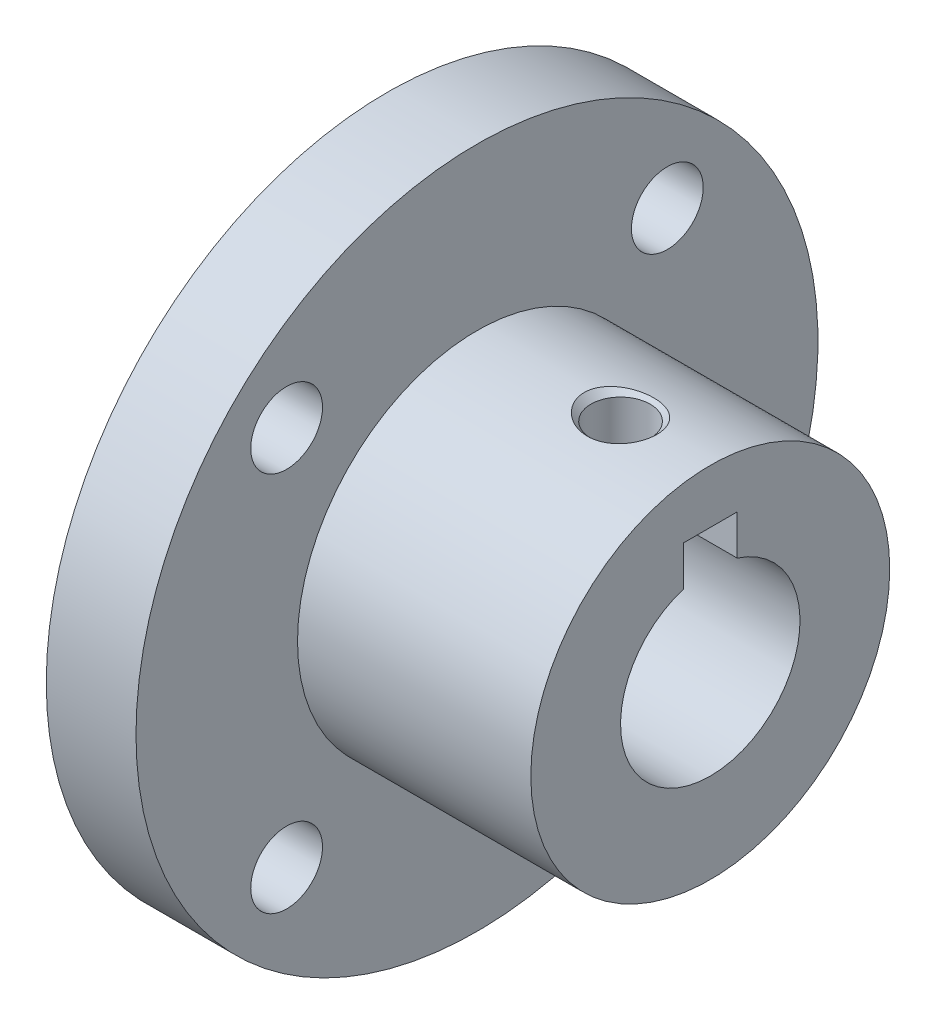
ISO-10303-21;
HEADER;
FILE_DESCRIPTION(('STEP AP214'),'2;1');
FILE_NAME('part.step','',(''),(''),'','','');
FILE_SCHEMA(('AUTOMOTIVE_DESIGN { 1 0 10303 214 1 1 1 1 }'));
ENDSEC;
DATA;
#1=APPLICATION_CONTEXT('core data for automotive mechanical design processes');
#2=APPLICATION_PROTOCOL_DEFINITION('international standard','automotive_design',2000,#1);
#3=PRODUCT_CONTEXT('',#1,'mechanical');
#4=PRODUCT('Part','Part','',(#3));
#5=PRODUCT_RELATED_PRODUCT_CATEGORY('part','',(#4));
#6=PRODUCT_DEFINITION_FORMATION('','',#4);
#7=PRODUCT_DEFINITION_CONTEXT('part definition',#1,'design');
#8=PRODUCT_DEFINITION('design','',#6,#7);
#9=PRODUCT_DEFINITION_SHAPE('','',#8);
#10=(LENGTH_UNIT() NAMED_UNIT(*) SI_UNIT(.MILLI.,.METRE.));
#11=(NAMED_UNIT(*) PLANE_ANGLE_UNIT() SI_UNIT($,.RADIAN.));
#12=(NAMED_UNIT(*) SI_UNIT($,.STERADIAN.) SOLID_ANGLE_UNIT());
#13=UNCERTAINTY_MEASURE_WITH_UNIT(LENGTH_MEASURE(1.E-05),#10,'distance_accuracy_value','');
#14=(GEOMETRIC_REPRESENTATION_CONTEXT(3) GLOBAL_UNCERTAINTY_ASSIGNED_CONTEXT((#13)) GLOBAL_UNIT_ASSIGNED_CONTEXT((#10,
#11,#12)) REPRESENTATION_CONTEXT('',''));
#15=CARTESIAN_POINT('',(0.,0.,0.));
#16=DIRECTION('',(0.,0.,1.));
#17=DIRECTION('',(1.,0.,0.));
#18=AXIS2_PLACEMENT_3D('',#15,#16,#17);
#19=CARTESIAN_POINT('',(13.,0.,0.));
#20=DIRECTION('',(-1.,0.,0.));
#21=DIRECTION('',(0.,0.,1.));
#22=AXIS2_PLACEMENT_3D('',#19,#20,#21);
#23=CYLINDRICAL_SURFACE('',#22,10.);
#24=CARTESIAN_POINT('',(6.62523194216559,9.90736802604839,-1.35796131641272));
#25=CARTESIAN_POINT('',(6.69783919281197,9.89893781323184,-1.41946863578843));
#26=CARTESIAN_POINT('',(6.77491076012761,9.89064161185237,-1.47574898579946));
#27=CARTESIAN_POINT('',(6.93621862361755,9.87498344965347,-1.57712931763381));
#28=CARTESIAN_POINT('',(7.02046116773056,9.86762231774959,-1.62221941287872));
#29=CARTESIAN_POINT('',(7.21233838553293,9.85304586092752,-1.7087444626504));
#30=CARTESIAN_POINT('',(7.32121454297018,9.84617361659741,-1.74750834745706));
#31=CARTESIAN_POINT('',(7.54388947643843,9.83537879828483,-1.80727639277504));
#32=CARTESIAN_POINT('',(7.6576904047215,9.83145752800609,-1.82827270430212));
#33=CARTESIAN_POINT('',(7.89207227344909,9.82689477486347,-1.8526491605562));
#34=CARTESIAN_POINT('',(8.01273748718097,9.82639762440689,-1.85525419181856));
#35=CARTESIAN_POINT('',(8.25283674094449,9.82912632962595,-1.84074068154992));
#36=CARTESIAN_POINT('',(8.37227069449417,9.83235244504501,-1.82362076396227));
#37=CARTESIAN_POINT('',(8.60775519415414,9.84220308661511,-1.76968755000167));
#38=CARTESIAN_POINT('',(8.72375918874116,9.84886172005461,-1.73267644427726));
#39=CARTESIAN_POINT('',(8.9476467818367,9.86479978630317,-1.63949644809677));
#40=CARTESIAN_POINT('',(9.05552983331101,9.87407939546384,-1.58332626847493));
#41=CARTESIAN_POINT('',(9.25752884889123,9.8939055283814,-1.45423433238783));
#42=CARTESIAN_POINT('',(9.35188217067214,9.90442209765625,-1.38168054839768));
#43=CARTESIAN_POINT('',(9.52593422696576,9.92554684431106,-1.22068986754564));
#44=CARTESIAN_POINT('',(9.60563846790559,9.93615498569378,-1.13225896352841));
#45=CARTESIAN_POINT('',(9.74219766665582,9.95536166877077,-0.948031147495123));
#46=CARTESIAN_POINT('',(9.80021427543135,9.96404667399645,-0.853106817833625));
#47=CARTESIAN_POINT('',(9.89760593551252,9.97909069905062,-0.653967103621671));
#48=CARTESIAN_POINT('',(9.93699638125858,9.98545163871683,-0.549759476636914));
#49=CARTESIAN_POINT('',(9.99214198981141,9.99448215639824,-0.345981470444367));
#50=CARTESIAN_POINT('',(10.0098206093733,9.99745017058104,-0.246943190152349));
#51=CARTESIAN_POINT('',(10.0273088049741,10.0003856828198,-0.0472696538945304));
#52=CARTESIAN_POINT('',(10.0271260317223,10.00035446556,0.0533648998585387));
#53=CARTESIAN_POINT('',(10.0094925994018,9.9973955986688,0.246682928147122));
#54=CARTESIAN_POINT('',(9.99312165692085,9.99464905770645,0.339470305692501));
#55=CARTESIAN_POINT('',(9.94545803929661,9.98683169281562,0.521010384653564));
#56=CARTESIAN_POINT('',(9.91416486083189,9.98176079048754,0.609762949865935));
#57=CARTESIAN_POINT('',(9.83731203614464,9.96972301768392,0.782464125794809));
#58=CARTESIAN_POINT('',(9.79152452197848,9.96272611487291,0.866308728834184));
#59=CARTESIAN_POINT('',(9.68754845694668,9.94757234804424,1.02578406128009));
#60=CARTESIAN_POINT('',(9.62935633569942,9.93941515028769,1.10141241634669));
#61=CARTESIAN_POINT('',(9.49745056621509,9.92204036888061,1.24861234707649));
#62=CARTESIAN_POINT('',(9.42288298851593,9.91278961610896,1.31941399778415));
#63=CARTESIAN_POINT('',(9.26371727552612,9.89472007076736,1.44871894926825));
#64=CARTESIAN_POINT('',(9.17911528952318,9.8859014458733,1.50721750468489));
#65=CARTESIAN_POINT('',(8.99411907198208,9.86877679458821,1.61571569995325));
#66=CARTESIAN_POINT('',(8.89298894838898,9.8605878511428,1.66448096588397));
#67=CARTESIAN_POINT('',(8.68419371357368,9.84655294135032,1.74559260958259));
#68=CARTESIAN_POINT('',(8.57652669079741,9.84070766418702,1.77793415849942));
#69=CARTESIAN_POINT('',(8.35080924067217,9.83169934741051,1.82711867402177));
#70=CARTESIAN_POINT('',(8.23252303332838,9.82871777907494,1.84291819403846));
#71=CARTESIAN_POINT('',(7.99490994809975,9.8264037051387,1.85521639700497));
#72=CARTESIAN_POINT('',(7.87558291027889,9.82707177057367,1.8517120595988));
#73=CARTESIAN_POINT('',(7.63665824826107,9.83203394576607,1.82518371839159));
#74=CARTESIAN_POINT('',(7.51710686788591,9.83640337684123,1.80175420602767));
#75=CARTESIAN_POINT('',(7.28373855388937,9.84835156741167,1.73525339810649));
#76=CARTESIAN_POINT('',(7.16992216664747,9.85593063204801,1.69218023499007));
#77=CARTESIAN_POINT('',(6.95248803059956,9.87330462079541,1.58764853274368));
#78=CARTESIAN_POINT('',(6.8487880743695,9.88307909243764,1.52635810235744));
#79=CARTESIAN_POINT('',(6.65391834298901,9.90367829676326,1.38641240493075));
#80=CARTESIAN_POINT('',(6.56274646663267,9.91450285280598,1.30776005560808));
#81=CARTESIAN_POINT('',(6.40062237541939,9.9352574532267,1.13908188823872));
#82=CARTESIAN_POINT('',(6.32889783389474,9.94520533201563,1.04980300437586));
#83=CARTESIAN_POINT('',(6.20321997935349,9.96346461692173,0.859348884798333));
#84=CARTESIAN_POINT('',(6.14925327297398,9.97177725446308,0.758182693279938));
#85=CARTESIAN_POINT('',(6.06595980237666,9.98494524743889,0.556854108635767));
#86=CARTESIAN_POINT('',(6.03482117464642,9.99004854569139,0.457457749779857));
#87=CARTESIAN_POINT('',(5.99114012573514,9.99727291206658,0.254568224808397));
#88=CARTESIAN_POINT('',(5.97858573935232,9.99939589897517,0.151077738751544));
#89=CARTESIAN_POINT('',(5.97298519710513,10.0003395680486,-0.0478751925700371));
#90=CARTESIAN_POINT('',(5.97841756367136,9.99941781699535,-0.143296865694244));
#91=CARTESIAN_POINT('',(6.00522902975338,9.99493833645858,-0.331805238567409));
#92=CARTESIAN_POINT('',(6.02660820990853,9.99138059364546,-0.424891926506421));
#93=CARTESIAN_POINT('',(6.08400648006393,9.98207905300167,-0.605113148381078));
#94=CARTESIAN_POINT('',(6.11985669421795,9.97636051903066,-0.692303237133997));
#95=CARTESIAN_POINT('',(6.20475637192994,9.96332123842221,-0.85982156892986));
#96=CARTESIAN_POINT('',(6.25380276089865,9.95600086507294,-0.94015140461344));
#97=CARTESIAN_POINT('',(6.35410252566645,9.94177087307553,-1.07946317263931));
#98=CARTESIAN_POINT('',(6.40357528819235,9.93500166335472,-1.13975648501532));
#99=CARTESIAN_POINT('',(6.50944812354738,9.92124773343471,-1.25385164781352));
#100=CARTESIAN_POINT('',(6.56584682506399,9.9142630561018,-1.30765477910116));
#101=CARTESIAN_POINT('',(6.62523194216559,9.90736802604839,-1.35796131641272));
#102=B_SPLINE_CURVE_WITH_KNOTS('',3,(#24,#25,#26,#27,#28,#29,#30,#31,#32,#33,#34,#35,#36,#37,
#38,#39,#40,#41,#42,#43,#44,#45,#46,#47,#48,#49,#50,#51,#52,#53,#54,#55,#56,#57,#58,#59,#60,#61,
#62,#63,#64,#65,#66,#67,#68,#69,#70,#71,#72,#73,#74,#75,#76,#77,#78,#79,#80,#81,#82,#83,#84,#85,
#86,#87,#88,#89,#90,#91,#92,#93,#94,#95,#96,#97,#98,#99,#100,#101),.UNSPECIFIED.,.T.,.F.,(4,2,2,
2,2,2,2,2,2,2,2,2,2,2,2,2,2,2,2,2,2,2,2,2,2,2,2,2,2,2,2,2,2,2,2,2,2,2,4),(0.,0.28638592568935,
0.573023979432038,0.918769623563071,1.26466792430608,1.62506176926063,1.98548075761981,
2.34955213571681,2.71364801609278,3.07026159692397,3.42674085528171,3.75966963128088,
4.09232276009592,4.39267818223635,4.69290495136607,4.97437171871268,5.25584798049907,
5.54198967802629,5.82821384635188,6.13664362869989,6.4451921565268,6.7814391947746,
7.11778503819274,7.47426132414426,7.83079338733426,8.19476000774969,8.55876123837842,
8.91950258000226,9.28018334415166,9.62317582205825,9.96590901110252,10.2770696512965,
10.5880298678335,10.8733805021873,11.1587325795036,11.4408466889663,11.72289512523,
11.9571750927887,12.1914087482695),.UNSPECIFIED.);
#103=CARTESIAN_POINT('',(6.62523194216559,9.90736802604839,-1.35796131641272));
#104=VERTEX_POINT('',#103);
#105=EDGE_CURVE('E232',#104,#104,#102,.T.);
#106=ORIENTED_EDGE('',*,*,#105,.T.);
#107=EDGE_LOOP('',(#106));
#108=FACE_BOUND('',#107,.T.);
#109=CARTESIAN_POINT('',(13.,0.,0.));
#110=DIRECTION('',(1.,0.,0.));
#111=DIRECTION('',(0.,0.,-1.));
#112=AXIS2_PLACEMENT_3D('',#109,#110,#111);
#113=CIRCLE('',#112,10.);
#114=CARTESIAN_POINT('',(13.,0.,-10.));
#115=VERTEX_POINT('',#114);
#116=EDGE_CURVE('E228',#115,#115,#113,.T.);
#117=ORIENTED_EDGE('',*,*,#116,.F.);
#118=EDGE_LOOP('',(#117));
#119=FACE_BOUND('',#118,.T.);
#120=CARTESIAN_POINT('',(0.,0.,0.));
#121=DIRECTION('',(1.,0.,0.));
#122=DIRECTION('',(0.,0.,-1.));
#123=AXIS2_PLACEMENT_3D('',#120,#121,#122);
#124=CIRCLE('',#123,10.);
#125=CARTESIAN_POINT('',(0.,0.,-10.));
#126=VERTEX_POINT('',#125);
#127=EDGE_CURVE('E224',#126,#126,#124,.T.);
#128=ORIENTED_EDGE('',*,*,#127,.T.);
#129=EDGE_LOOP('',(#128));
#130=FACE_BOUND('',#129,.T.);
#131=ADVANCED_FACE('F51',(#108,#119,#130),#23,.T.);
#132=CARTESIAN_POINT('',(13.,0.,0.));
#133=DIRECTION('',(1.,0.,0.));
#134=DIRECTION('',(0.,0.,-1.));
#135=AXIS2_PLACEMENT_3D('',#132,#133,#134);
#136=PLANE('',#135);
#137=DIRECTION('',(0.,1.,0.));
#138=VECTOR('',#137,1.);
#139=CARTESIAN_POINT('',(13.,7.,-1.5));
#140=LINE('',#139,#138);
#141=CARTESIAN_POINT('',(13.,4.76969600708473,-1.5));
#142=VERTEX_POINT('',#141);
#143=CARTESIAN_POINT('',(13.,7.,-1.5));
#144=VERTEX_POINT('',#143);
#145=EDGE_CURVE('E155',#142,#144,#140,.T.);
#146=ORIENTED_EDGE('',*,*,#145,.F.);
#147=CARTESIAN_POINT('',(13.,0.,0.));
#148=DIRECTION('',(1.,0.,0.));
#149=DIRECTION('',(0.,0.,-1.));
#150=AXIS2_PLACEMENT_3D('',#147,#148,#149);
#151=CIRCLE('',#150,5.);
#152=CARTESIAN_POINT('',(13.,4.76969600708473,1.5));
#153=VERTEX_POINT('',#152);
#154=EDGE_CURVE('E175',#153,#142,#151,.T.);
#155=ORIENTED_EDGE('',*,*,#154,.F.);
#156=DIRECTION('',(0.,-1.,0.));
#157=VECTOR('',#156,1.);
#158=CARTESIAN_POINT('',(13.,7.,1.5));
#159=LINE('',#158,#157);
#160=CARTESIAN_POINT('',(13.,7.,1.5));
#161=VERTEX_POINT('',#160);
#162=EDGE_CURVE('E75',#161,#153,#159,.T.);
#163=ORIENTED_EDGE('',*,*,#162,.F.);
#164=DIRECTION('',(0.,0.,1.));
#165=VECTOR('',#164,1.);
#166=CARTESIAN_POINT('',(13.,7.,-1.5));
#167=LINE('',#166,#165);
#168=EDGE_CURVE('E151',#144,#161,#167,.T.);
#169=ORIENTED_EDGE('',*,*,#168,.F.);
#170=EDGE_LOOP('',(#146,#155,#163,#169));
#171=FACE_BOUND('',#170,.T.);
#172=ORIENTED_EDGE('',*,*,#116,.T.);
#173=EDGE_LOOP('',(#172));
#174=FACE_BOUND('',#173,.T.);
#175=ADVANCED_FACE('F282',(#171,#174),#136,.T.);
#176=CARTESIAN_POINT('',(-5.,0.,0.));
#177=DIRECTION('',(-1.,0.,0.));
#178=DIRECTION('',(0.,0.,1.));
#179=AXIS2_PLACEMENT_3D('',#176,#177,#178);
#180=PLANE('',#179);
#181=DIRECTION('',(0.,1.,0.));
#182=VECTOR('',#181,1.);
#183=CARTESIAN_POINT('',(-5.,7.,-1.5));
#184=LINE('',#183,#182);
#185=CARTESIAN_POINT('',(-5.,4.76969600708473,-1.5));
#186=VERTEX_POINT('',#185);
#187=CARTESIAN_POINT('',(-5.,7.,-1.5));
#188=VERTEX_POINT('',#187);
#189=EDGE_CURVE('E121',#186,#188,#184,.T.);
#190=ORIENTED_EDGE('',*,*,#189,.T.);
#191=DIRECTION('',(0.,0.,1.));
#192=VECTOR('',#191,1.);
#193=CARTESIAN_POINT('',(-5.,7.,-1.5));
#194=LINE('',#193,#192);
#195=CARTESIAN_POINT('',(-5.,7.,1.5));
#196=VERTEX_POINT('',#195);
#197=EDGE_CURVE('E131',#188,#196,#194,.T.);
#198=ORIENTED_EDGE('',*,*,#197,.T.);
#199=DIRECTION('',(0.,-1.,0.));
#200=VECTOR('',#199,1.);
#201=CARTESIAN_POINT('',(-5.,7.,1.5));
#202=LINE('',#201,#200);
#203=CARTESIAN_POINT('',(-5.,4.76969600708473,1.5));
#204=VERTEX_POINT('',#203);
#205=EDGE_CURVE('E138',#196,#204,#202,.T.);
#206=ORIENTED_EDGE('',*,*,#205,.T.);
#207=CARTESIAN_POINT('',(-5.,0.,0.));
#208=DIRECTION('',(-1.,0.,0.));
#209=DIRECTION('',(0.,0.,1.));
#210=AXIS2_PLACEMENT_3D('',#207,#208,#209);
#211=CIRCLE('',#210,5.);
#212=EDGE_CURVE('E144',#186,#204,#211,.T.);
#213=ORIENTED_EDGE('',*,*,#212,.F.);
#214=EDGE_LOOP('',(#190,#198,#206,#213));
#215=FACE_BOUND('',#214,.T.);
#216=CARTESIAN_POINT('',(-5.,-10.6066017177982,10.6066017177982));
#217=DIRECTION('',(-1.,0.,0.));
#218=DIRECTION('',(0.,0.,1.));
#219=AXIS2_PLACEMENT_3D('',#216,#217,#218);
#220=CIRCLE('',#219,2.);
#221=CARTESIAN_POINT('',(-5.,-10.6066017177982,12.6066017177982));
#222=VERTEX_POINT('',#221);
#223=EDGE_CURVE('E196',#222,#222,#220,.T.);
#224=ORIENTED_EDGE('',*,*,#223,.F.);
#225=EDGE_LOOP('',(#224));
#226=FACE_BOUND('',#225,.T.);
#227=CARTESIAN_POINT('',(-5.,10.6066017177982,-10.6066017177982));
#228=DIRECTION('',(-1.,0.,0.));
#229=DIRECTION('',(0.,0.,1.));
#230=AXIS2_PLACEMENT_3D('',#227,#228,#229);
#231=CIRCLE('',#230,2.);
#232=CARTESIAN_POINT('',(-5.,10.6066017177982,-8.6066017177982));
#233=VERTEX_POINT('',#232);
#234=EDGE_CURVE('E212',#233,#233,#231,.T.);
#235=ORIENTED_EDGE('',*,*,#234,.F.);
#236=EDGE_LOOP('',(#235));
#237=FACE_BOUND('',#236,.T.);
#238=CARTESIAN_POINT('',(-5.,0.,0.));
#239=DIRECTION('',(-1.,0.,0.));
#240=DIRECTION('',(0.,0.,1.));
#241=AXIS2_PLACEMENT_3D('',#238,#239,#240);
#242=CIRCLE('',#241,19.);
#243=CARTESIAN_POINT('',(-5.,0.,19.));
#244=VERTEX_POINT('',#243);
#245=EDGE_CURVE('E220',#244,#244,#242,.T.);
#246=ORIENTED_EDGE('',*,*,#245,.T.);
#247=EDGE_LOOP('',(#246));
#248=FACE_BOUND('',#247,.T.);
#249=CARTESIAN_POINT('',(-5.,10.6066017177982,10.6066017177982));
#250=DIRECTION('',(-1.,0.,0.));
#251=DIRECTION('',(0.,0.,-1.));
#252=AXIS2_PLACEMENT_3D('',#249,#250,#251);
#253=CIRCLE('',#252,2.);
#254=CARTESIAN_POINT('',(-5.,10.6066017177982,8.6066017177982));
#255=VERTEX_POINT('',#254);
#256=EDGE_CURVE('E204',#255,#255,#253,.T.);
#257=ORIENTED_EDGE('',*,*,#256,.F.);
#258=EDGE_LOOP('',(#257));
#259=FACE_BOUND('',#258,.T.);
#260=CARTESIAN_POINT('',(-5.,-10.6066017177982,-10.6066017177982));
#261=DIRECTION('',(-1.,0.,0.));
#262=DIRECTION('',(0.,0.,-1.));
#263=AXIS2_PLACEMENT_3D('',#260,#261,#262);
#264=CIRCLE('',#263,2.);
#265=CARTESIAN_POINT('',(-5.,-10.6066017177982,-12.6066017177982));
#266=VERTEX_POINT('',#265);
#267=EDGE_CURVE('E188',#266,#266,#264,.T.);
#268=ORIENTED_EDGE('',*,*,#267,.F.);
#269=EDGE_LOOP('',(#268));
#270=FACE_BOUND('',#269,.T.);
#271=ADVANCED_FACE('F141',(#215,#226,#237,#248,#259,#270),#180,.T.);
#272=CARTESIAN_POINT('',(0.,0.,0.));
#273=DIRECTION('',(-1.,0.,0.));
#274=DIRECTION('',(0.,0.,1.));
#275=AXIS2_PLACEMENT_3D('',#272,#273,#274);
#276=PLANE('',#275);
#277=ORIENTED_EDGE('',*,*,#127,.F.);
#278=EDGE_LOOP('',(#277));
#279=FACE_BOUND('',#278,.T.);
#280=CARTESIAN_POINT('',(0.,0.,0.));
#281=DIRECTION('',(-1.,0.,0.));
#282=DIRECTION('',(0.,0.,1.));
#283=AXIS2_PLACEMENT_3D('',#280,#281,#282);
#284=CIRCLE('',#283,19.);
#285=CARTESIAN_POINT('',(0.,0.,19.));
#286=VERTEX_POINT('',#285);
#287=EDGE_CURVE('E216',#286,#286,#284,.T.);
#288=ORIENTED_EDGE('',*,*,#287,.F.);
#289=EDGE_LOOP('',(#288));
#290=FACE_BOUND('',#289,.T.);
#291=CARTESIAN_POINT('',(0.,10.6066017177982,-10.6066017177982));
#292=DIRECTION('',(-1.,0.,0.));
#293=DIRECTION('',(0.,0.,1.));
#294=AXIS2_PLACEMENT_3D('',#291,#292,#293);
#295=CIRCLE('',#294,2.);
#296=CARTESIAN_POINT('',(0.,10.6066017177982,-8.6066017177982));
#297=VERTEX_POINT('',#296);
#298=EDGE_CURVE('E208',#297,#297,#295,.T.);
#299=ORIENTED_EDGE('',*,*,#298,.T.);
#300=EDGE_LOOP('',(#299));
#301=FACE_BOUND('',#300,.T.);
#302=CARTESIAN_POINT('',(0.,10.6066017177982,10.6066017177982));
#303=DIRECTION('',(-1.,0.,0.));
#304=DIRECTION('',(0.,0.,-1.));
#305=AXIS2_PLACEMENT_3D('',#302,#303,#304);
#306=CIRCLE('',#305,2.);
#307=CARTESIAN_POINT('',(0.,10.6066017177982,8.6066017177982));
#308=VERTEX_POINT('',#307);
#309=EDGE_CURVE('E200',#308,#308,#306,.T.);
#310=ORIENTED_EDGE('',*,*,#309,.T.);
#311=EDGE_LOOP('',(#310));
#312=FACE_BOUND('',#311,.T.);
#313=CARTESIAN_POINT('',(0.,-10.6066017177982,10.6066017177982));
#314=DIRECTION('',(-1.,0.,0.));
#315=DIRECTION('',(0.,0.,1.));
#316=AXIS2_PLACEMENT_3D('',#313,#314,#315);
#317=CIRCLE('',#316,2.);
#318=CARTESIAN_POINT('',(0.,-10.6066017177982,12.6066017177982));
#319=VERTEX_POINT('',#318);
#320=EDGE_CURVE('E192',#319,#319,#317,.T.);
#321=ORIENTED_EDGE('',*,*,#320,.T.);
#322=EDGE_LOOP('',(#321));
#323=FACE_BOUND('',#322,.T.);
#324=CARTESIAN_POINT('',(0.,-10.6066017177982,-10.6066017177982));
#325=DIRECTION('',(-1.,0.,0.));
#326=DIRECTION('',(0.,0.,-1.));
#327=AXIS2_PLACEMENT_3D('',#324,#325,#326);
#328=CIRCLE('',#327,2.);
#329=CARTESIAN_POINT('',(0.,-10.6066017177982,-12.6066017177982));
#330=VERTEX_POINT('',#329);
#331=EDGE_CURVE('E187',#330,#330,#328,.T.);
#332=ORIENTED_EDGE('',*,*,#331,.T.);
#333=EDGE_LOOP('',(#332));
#334=FACE_BOUND('',#333,.T.);
#335=ADVANCED_FACE('F281',(#279,#290,#301,#312,#323,#334),#276,.F.);
#336=CARTESIAN_POINT('',(-5.,0.,0.));
#337=DIRECTION('',(1.,0.,0.));
#338=DIRECTION('',(0.,0.,-1.));
#339=AXIS2_PLACEMENT_3D('',#336,#337,#338);
#340=CYLINDRICAL_SURFACE('',#339,19.);
#341=ORIENTED_EDGE('',*,*,#245,.F.);
#342=EDGE_LOOP('',(#341));
#343=FACE_BOUND('',#342,.T.);
#344=ORIENTED_EDGE('',*,*,#287,.T.);
#345=EDGE_LOOP('',(#344));
#346=FACE_BOUND('',#345,.T.);
#347=ADVANCED_FACE('F277',(#343,#346),#340,.T.);
#348=CARTESIAN_POINT('',(-5.,10.6066017177982,-10.6066017177982));
#349=DIRECTION('',(1.,0.,0.));
#350=DIRECTION('',(0.,0.,-1.));
#351=AXIS2_PLACEMENT_3D('',#348,#349,#350);
#352=CYLINDRICAL_SURFACE('',#351,2.);
#353=ORIENTED_EDGE('',*,*,#234,.T.);
#354=EDGE_LOOP('',(#353));
#355=FACE_BOUND('',#354,.T.);
#356=ORIENTED_EDGE('',*,*,#298,.F.);
#357=EDGE_LOOP('',(#356));
#358=FACE_BOUND('',#357,.T.);
#359=ADVANCED_FACE('F273',(#355,#358),#352,.F.);
#360=CARTESIAN_POINT('',(-5.,10.6066017177982,10.6066017177982));
#361=DIRECTION('',(1.,0.,0.));
#362=DIRECTION('',(0.,0.,-1.));
#363=AXIS2_PLACEMENT_3D('',#360,#361,#362);
#364=CYLINDRICAL_SURFACE('',#363,2.);
#365=ORIENTED_EDGE('',*,*,#256,.T.);
#366=EDGE_LOOP('',(#365));
#367=FACE_BOUND('',#366,.T.);
#368=ORIENTED_EDGE('',*,*,#309,.F.);
#369=EDGE_LOOP('',(#368));
#370=FACE_BOUND('',#369,.T.);
#371=ADVANCED_FACE('F269',(#367,#370),#364,.F.);
#372=CARTESIAN_POINT('',(-5.,-10.6066017177982,10.6066017177982));
#373=DIRECTION('',(1.,0.,0.));
#374=DIRECTION('',(0.,0.,-1.));
#375=AXIS2_PLACEMENT_3D('',#372,#373,#374);
#376=CYLINDRICAL_SURFACE('',#375,2.);
#377=ORIENTED_EDGE('',*,*,#223,.T.);
#378=EDGE_LOOP('',(#377));
#379=FACE_BOUND('',#378,.T.);
#380=ORIENTED_EDGE('',*,*,#320,.F.);
#381=EDGE_LOOP('',(#380));
#382=FACE_BOUND('',#381,.T.);
#383=ADVANCED_FACE('F265',(#379,#382),#376,.F.);
#384=CARTESIAN_POINT('',(-5.,-10.6066017177982,-10.6066017177982));
#385=DIRECTION('',(1.,0.,0.));
#386=DIRECTION('',(0.,0.,-1.));
#387=AXIS2_PLACEMENT_3D('',#384,#385,#386);
#388=CYLINDRICAL_SURFACE('',#387,2.);
#389=ORIENTED_EDGE('',*,*,#267,.T.);
#390=EDGE_LOOP('',(#389));
#391=FACE_BOUND('',#390,.T.);
#392=ORIENTED_EDGE('',*,*,#331,.F.);
#393=EDGE_LOOP('',(#392));
#394=FACE_BOUND('',#393,.T.);
#395=ADVANCED_FACE('F254',(#391,#394),#388,.F.);
#396=CARTESIAN_POINT('',(8.,10.,0.));
#397=DIRECTION('',(0.,1.,0.));
#398=DIRECTION('',(0.,0.,1.));
#399=AXIS2_PLACEMENT_3D('',#396,#397,#398);
#400=CONICAL_SURFACE('',#399,2.025,0.785398163397446);
#401=CARTESIAN_POINT('',(8.,9.625,0.));
#402=DIRECTION('',(0.,1.,0.));
#403=DIRECTION('',(0.,0.,1.));
#404=AXIS2_PLACEMENT_3D('',#401,#402,#403);
#405=CIRCLE('',#404,1.65);
#406=CARTESIAN_POINT('',(8.,9.625,1.65));
#407=VERTEX_POINT('',#406);
#408=EDGE_CURVE('E182',#407,#407,#405,.T.);
#409=ORIENTED_EDGE('',*,*,#408,.F.);
#410=EDGE_LOOP('',(#409));
#411=FACE_BOUND('',#410,.T.);
#412=ORIENTED_EDGE('',*,*,#105,.F.);
#413=EDGE_LOOP('',(#412));
#414=FACE_BOUND('',#413,.T.);
#415=ADVANCED_FACE('F250',(#411,#414),#400,.F.);
#416=CARTESIAN_POINT('',(8.,10.,0.));
#417=DIRECTION('',(0.,1.,0.));
#418=DIRECTION('',(0.,0.,1.));
#419=AXIS2_PLACEMENT_3D('',#416,#417,#418);
#420=CYLINDRICAL_SURFACE('',#419,1.65);
#421=CARTESIAN_POINT('',(8.,7.,0.));
#422=DIRECTION('',(0.,1.,0.));
#423=DIRECTION('',(0.,0.,1.));
#424=AXIS2_PLACEMENT_3D('',#421,#422,#423);
#425=CIRCLE('',#424,1.65);
#426=CARTESIAN_POINT('',(7.31261364575663,7.,1.5));
#427=VERTEX_POINT('',#426);
#428=CARTESIAN_POINT('',(7.31261364575663,7.,-1.5));
#429=VERTEX_POINT('',#428);
#430=EDGE_CURVE('E13',#427,#429,#425,.F.);
#431=ORIENTED_EDGE('',*,*,#430,.T.);
#432=DIRECTION('',(0.,1.,0.));
#433=VECTOR('',#432,1.);
#434=CARTESIAN_POINT('',(7.31261364575663,10.,-1.5));
#435=LINE('',#434,#433);
#436=CARTESIAN_POINT('',(7.31261364575663,4.76969600708473,-1.5));
#437=VERTEX_POINT('',#436);
#438=EDGE_CURVE('E124',#429,#437,#435,.F.);
#439=ORIENTED_EDGE('',*,*,#438,.T.);
#440=CARTESIAN_POINT('',(8.,4.71990466005406,1.65));
#441=CARTESIAN_POINT('',(7.91007060070937,4.71990452115883,1.65000024360503));
#442=CARTESIAN_POINT('',(7.82014231350031,4.72250292266519,1.64262303818655));
#443=CARTESIAN_POINT('',(7.64294632656482,4.73256311651638,1.61340616817484));
#444=CARTESIAN_POINT('',(7.55567911253961,4.74002579119602,1.59156387973589));
#445=CARTESIAN_POINT('',(7.38640030062093,4.75887919770346,1.53426465819808));
#446=CARTESIAN_POINT('',(7.30437892233647,4.77026235105614,1.49883397722407));
#447=CARTESIAN_POINT('',(7.1474185036429,4.79566317693293,1.41545303535855));
#448=CARTESIAN_POINT('',(7.07248098153631,4.80968141232602,1.36750009878646));
#449=CARTESIAN_POINT('',(6.92894236061176,4.83937566103107,1.25846654308765));
#450=CARTESIAN_POINT('',(6.86065251426647,4.85509238793419,1.1969871597991));
#451=CARTESIAN_POINT('',(6.73514073232111,4.88606822622471,1.06349727663171));
#452=CARTESIAN_POINT('',(6.677920534534,4.90132726544299,0.991485126335476));
#453=CARTESIAN_POINT('',(6.57476641097718,4.93013890958224,0.836704215602399));
#454=CARTESIAN_POINT('',(6.52915769359331,4.94363804307574,0.753707887278362));
#455=CARTESIAN_POINT('',(6.45267126515024,4.9669298740668,0.580699685040884));
#456=CARTESIAN_POINT('',(6.42178966794346,4.97672354920831,0.490689669179503));
#457=CARTESIAN_POINT('',(6.37668692812485,4.99121262924257,0.309471831071058));
#458=CARTESIAN_POINT('',(6.36193278501146,4.99607073696453,0.218409916306845));
#459=CARTESIAN_POINT('',(6.34781000128519,5.00071837425094,0.0349820134684157));
#460=CARTESIAN_POINT('',(6.34843747215392,5.00050918484354,-0.0573836391159477));
#461=CARTESIAN_POINT('',(6.36471997454315,4.99515654976729,-0.237027933093925));
#462=CARTESIAN_POINT('',(6.3797962649372,4.99020313675408,-0.324365615952689));
#463=CARTESIAN_POINT('',(6.42359260318569,4.9761564157389,-0.495193577669011));
#464=CARTESIAN_POINT('',(6.45231357082426,4.96706282865059,-0.578683596740283));
#465=CARTESIAN_POINT('',(6.52292737806423,4.94551338736031,-0.740723104693063));
#466=CARTESIAN_POINT('',(6.56498668425741,4.93301533884174,-0.819194207586597));
#467=CARTESIAN_POINT('',(6.66094667503865,4.90596050876768,-0.96813740001638));
#468=CARTESIAN_POINT('',(6.71485060572331,4.89140316323876,-1.03860728872218));
#469=CARTESIAN_POINT('',(6.83589517646717,4.86097294536879,-1.1729917525873));
#470=CARTESIAN_POINT('',(6.90353230573436,4.84507036749807,-1.23645304594368));
#471=CARTESIAN_POINT('',(7.04862658963557,4.81431124792123,-1.35127700383062));
#472=CARTESIAN_POINT('',(7.12608519304115,4.79945486104327,-1.4026378802203));
#473=CARTESIAN_POINT('',(7.29003439885756,4.77230967313122,-1.49241382326107));
#474=CARTESIAN_POINT('',(7.37663438766137,4.76005891661914,-1.5306415054313));
#475=CARTESIAN_POINT('',(7.55554760715751,4.73995346804782,-1.59181981773764));
#476=CARTESIAN_POINT('',(7.64785848345827,4.73209697762928,-1.61477669819906));
#477=CARTESIAN_POINT('',(7.83119016769925,4.72207527963097,-1.64384682592321));
#478=CARTESIAN_POINT('',(7.9220868443492,4.71967327795615,-1.6506614560171));
#479=CARTESIAN_POINT('',(8.10373784788793,4.7201713665852,-1.64923749492087));
#480=CARTESIAN_POINT('',(8.19449219712919,4.72307051828914,-1.64100156851918));
#481=CARTESIAN_POINT('',(8.37012007223667,4.73360855675225,-1.61033997123775));
#482=CARTESIAN_POINT('',(8.45508876939676,4.74108573426459,-1.5883979271959));
#483=CARTESIAN_POINT('',(8.62012260701674,4.75976051805482,-1.53152522846697));
#484=CARTESIAN_POINT('',(8.7001868863261,4.77095877549974,-1.49659230032422));
#485=CARTESIAN_POINT('',(8.85591002704081,4.79624726899171,-1.41348842564754));
#486=CARTESIAN_POINT('',(8.93135316902562,4.81041691149476,-1.36493806698654));
#487=CARTESIAN_POINT('',(9.07327560374667,4.83989585604412,-1.25640957990473));
#488=CARTESIAN_POINT('',(9.13975229532687,4.85520548680903,-1.19642814746825));
#489=CARTESIAN_POINT('',(9.26508318078348,4.88610989384612,-1.06339123842035));
#490=CARTESIAN_POINT('',(9.32343223892652,4.90168425037641,-0.98985376392305));
#491=CARTESIAN_POINT('',(9.42699264159109,4.93065204495412,-0.833649177353404));
#492=CARTESIAN_POINT('',(9.47220447905245,4.94404556482344,-0.750982407994641));
#493=CARTESIAN_POINT('',(9.54778899225879,4.96707750850083,-0.579295715379799));
#494=CARTESIAN_POINT('',(9.57826045874353,4.976740841375,-0.490322802958604));
#495=CARTESIAN_POINT('',(9.62368669319226,4.99133146825929,-0.308134735858256));
#496=CARTESIAN_POINT('',(9.63864693846524,4.99626043401974,-0.214921090808604));
#497=CARTESIAN_POINT('',(9.65214081785687,5.00070328980923,-0.031522586469901));
#498=CARTESIAN_POINT('',(9.65140031208917,5.00045646732493,0.058603658066869));
#499=CARTESIAN_POINT('',(9.63529847572636,4.99516201889143,0.23738802829053));
#500=CARTESIAN_POINT('',(9.61993829171028,4.99011476942583,0.326046268553989));
#501=CARTESIAN_POINT('',(9.57551169407576,4.97587240449466,0.498029665785516));
#502=CARTESIAN_POINT('',(9.54665866508083,4.96674195827476,0.581415680377157));
#503=CARTESIAN_POINT('',(9.47626210521859,4.94527347683187,0.74219680742892));
#504=CARTESIAN_POINT('',(9.43471629488055,4.93293486552038,0.819590840669548));
#505=CARTESIAN_POINT('',(9.33836734607493,4.90576374946711,0.96926838093302));
#506=CARTESIAN_POINT('',(9.28313585190305,4.8908566849274,1.04126244269286));
#507=CARTESIAN_POINT('',(9.1617163493559,4.86041514438607,1.17519818555166));
#508=CARTESIAN_POINT('',(9.09552488070222,4.84488047141097,1.23713667964079));
#509=CARTESIAN_POINT('',(8.95104414854536,4.81423121094682,1.35160179814246));
#510=CARTESIAN_POINT('',(8.87238973051084,4.79915525016869,1.40367929286429));
#511=CARTESIAN_POINT('',(8.70697833787582,4.77186368687929,1.49383628223877));
#512=CARTESIAN_POINT('',(8.62022368716505,4.759647267495,1.5319197762739));
#513=CARTESIAN_POINT('',(8.44565672755677,4.74014636717988,1.59120734764471));
#514=CARTESIAN_POINT('',(8.35813195806479,4.7326392026776,1.61318355190477));
#515=CARTESIAN_POINT('',(8.18040382870731,4.7225192193515,1.64257737451178));
#516=CARTESIAN_POINT('',(8.09020135494474,4.71990479936932,1.64999975565827));
#517=CARTESIAN_POINT('',(8.,4.71990466005406,1.65));
#518=B_SPLINE_CURVE_WITH_KNOTS('',3,(#440,#441,#442,#443,#444,#445,#446,#447,#448,#449,#450,
#451,#452,#453,#454,#455,#456,#457,#458,#459,#460,#461,#462,#463,#464,#465,#466,#467,#468,#469,
#470,#471,#472,#473,#474,#475,#476,#477,#478,#479,#480,#481,#482,#483,#484,#485,#486,#487,#488,
#489,#490,#491,#492,#493,#494,#495,#496,#497,#498,#499,#500,#501,#502,#503,#504,#505,#506,#507,
#508,#509,#510,#511,#512,#513,#514,#515,#516,#517),.UNSPECIFIED.,.T.,.F.,(4,2,2,2,2,2,2,2,2,2,2,
2,2,2,2,2,2,2,2,2,2,2,2,2,2,2,2,2,2,2,2,2,2,2,2,2,2,2,4),(0.,0.269454302916434,
0.538957495994024,0.807942623457628,1.07698527314817,1.3553904348317,1.63383926765626,
1.91939248597707,2.2048703116341,2.48059787689522,2.75625573811558,3.02131448573183,
3.28639110342469,3.55491555402299,3.82351368748603,4.10452131305698,4.38557043856028,
4.67047751353534,4.95526790443248,5.22743703243198,5.49955797597572,5.76258081799806,
6.02564971172707,6.29693565916083,6.56830013781585,6.85241935986188,7.1365279197002,
7.4187050399578,7.70078248410446,7.96984890311454,8.23889422176275,8.50382155957888,
8.76879650315114,9.04343817678384,9.31816672608183,9.60337461850676,9.88850093710113,
10.1588585876967,10.4291277478431),.UNSPECIFIED.);
#519=CARTESIAN_POINT('',(8.68738635424337,4.76969600708473,-1.5));
#520=VERTEX_POINT('',#519);
#521=EDGE_CURVE('E183',#437,#520,#518,.T.);
#522=ORIENTED_EDGE('',*,*,#521,.T.);
#523=DIRECTION('',(0.,1.,0.));
#524=VECTOR('',#523,1.);
#525=CARTESIAN_POINT('',(8.68738635424337,10.,-1.5));
#526=LINE('',#525,#524);
#527=CARTESIAN_POINT('',(8.68738635424337,7.,-1.5));
#528=VERTEX_POINT('',#527);
#529=EDGE_CURVE('E171',#520,#528,#526,.T.);
#530=ORIENTED_EDGE('',*,*,#529,.T.);
#531=CARTESIAN_POINT('',(8.68738635424337,7.,1.5));
#532=VERTEX_POINT('',#531);
#533=EDGE_CURVE('E55',#528,#532,#425,.F.);
#534=ORIENTED_EDGE('',*,*,#533,.T.);
#535=DIRECTION('',(0.,1.,0.));
#536=VECTOR('',#535,1.);
#537=CARTESIAN_POINT('',(8.68738635424337,10.,1.5));
#538=LINE('',#537,#536);
#539=CARTESIAN_POINT('',(8.68738635424337,4.76969600708473,1.5));
#540=VERTEX_POINT('',#539);
#541=EDGE_CURVE('E163',#532,#540,#538,.F.);
#542=ORIENTED_EDGE('',*,*,#541,.T.);
#543=CARTESIAN_POINT('',(7.31261364575663,4.76969600708473,1.5));
#544=VERTEX_POINT('',#543);
#545=EDGE_CURVE('E179',#540,#544,#518,.T.);
#546=ORIENTED_EDGE('',*,*,#545,.T.);
#547=DIRECTION('',(0.,1.,0.));
#548=VECTOR('',#547,1.);
#549=CARTESIAN_POINT('',(7.31261364575663,10.,1.5));
#550=LINE('',#549,#548);
#551=EDGE_CURVE('E67',#544,#427,#550,.T.);
#552=ORIENTED_EDGE('',*,*,#551,.T.);
#553=EDGE_LOOP('',(#431,#439,#522,#530,#534,#542,#546,#552));
#554=FACE_BOUND('',#553,.T.);
#555=ORIENTED_EDGE('',*,*,#408,.T.);
#556=EDGE_LOOP('',(#555));
#557=FACE_BOUND('',#556,.T.);
#558=ADVANCED_FACE('F253',(#554,#557),#420,.F.);
#559=CARTESIAN_POINT('',(-7.,0.,0.));
#560=DIRECTION('',(1.,0.,0.));
#561=DIRECTION('',(0.,0.,-1.));
#562=AXIS2_PLACEMENT_3D('',#559,#560,#561);
#563=CYLINDRICAL_SURFACE('',#562,5.);
#564=ORIENTED_EDGE('',*,*,#154,.T.);
#565=DIRECTION('',(1.,0.,0.));
#566=VECTOR('',#565,1.);
#567=CARTESIAN_POINT('',(-7.,4.76969600708473,-1.5));
#568=LINE('',#567,#566);
#569=EDGE_CURVE('E322',#142,#520,#568,.F.);
#570=ORIENTED_EDGE('',*,*,#569,.T.);
#571=ORIENTED_EDGE('',*,*,#521,.F.);
#572=EDGE_CURVE('E331',#437,#186,#568,.F.);
#573=ORIENTED_EDGE('',*,*,#572,.T.);
#574=ORIENTED_EDGE('',*,*,#212,.T.);
#575=DIRECTION('',(1.,0.,0.));
#576=VECTOR('',#575,1.);
#577=CARTESIAN_POINT('',(-7.,4.76969600708473,1.5));
#578=LINE('',#577,#576);
#579=EDGE_CURVE('E327',#204,#544,#578,.T.);
#580=ORIENTED_EDGE('',*,*,#579,.T.);
#581=ORIENTED_EDGE('',*,*,#545,.F.);
#582=EDGE_CURVE('E243',#540,#153,#578,.T.);
#583=ORIENTED_EDGE('',*,*,#582,.T.);
#584=EDGE_LOOP('',(#564,#570,#571,#573,#574,#580,#581,#583));
#585=FACE_BOUND('',#584,.T.);
#586=ADVANCED_FACE('F256',(#585),#563,.F.);
#587=CARTESIAN_POINT('',(-5.,7.,1.5));
#588=DIRECTION('',(0.,0.,1.));
#589=DIRECTION('',(0.,-1.,0.));
#590=AXIS2_PLACEMENT_3D('',#587,#588,#589);
#591=PLANE('',#590);
#592=DIRECTION('',(1.,0.,0.));
#593=VECTOR('',#592,1.);
#594=CARTESIAN_POINT('',(-5.,7.,1.5));
#595=LINE('',#594,#593);
#596=EDGE_CURVE('E127',#532,#161,#595,.T.);
#597=ORIENTED_EDGE('',*,*,#596,.T.);
#598=ORIENTED_EDGE('',*,*,#162,.T.);
#599=ORIENTED_EDGE('',*,*,#582,.F.);
#600=ORIENTED_EDGE('',*,*,#541,.F.);
#601=EDGE_LOOP('',(#597,#598,#599,#600));
#602=FACE_BOUND('',#601,.T.);
#603=ADVANCED_FACE('F353',(#602),#591,.F.);
#604=CARTESIAN_POINT('',(-5.,7.,-1.5));
#605=DIRECTION('',(0.,0.,-1.));
#606=DIRECTION('',(0.,1.,0.));
#607=AXIS2_PLACEMENT_3D('',#604,#605,#606);
#608=PLANE('',#607);
#609=ORIENTED_EDGE('',*,*,#569,.F.);
#610=ORIENTED_EDGE('',*,*,#145,.T.);
#611=DIRECTION('',(1.,0.,0.));
#612=VECTOR('',#611,1.);
#613=CARTESIAN_POINT('',(-5.,7.,-1.5));
#614=LINE('',#613,#612);
#615=EDGE_CURVE('E128',#528,#144,#614,.T.);
#616=ORIENTED_EDGE('',*,*,#615,.F.);
#617=ORIENTED_EDGE('',*,*,#529,.F.);
#618=EDGE_LOOP('',(#609,#610,#616,#617));
#619=FACE_BOUND('',#618,.T.);
#620=ADVANCED_FACE('F343',(#619),#608,.F.);
#621=CARTESIAN_POINT('',(-5.,7.,-1.5));
#622=DIRECTION('',(0.,1.,0.));
#623=DIRECTION('',(0.,0.,1.));
#624=AXIS2_PLACEMENT_3D('',#621,#622,#623);
#625=PLANE('',#624);
#626=ORIENTED_EDGE('',*,*,#615,.T.);
#627=ORIENTED_EDGE('',*,*,#168,.T.);
#628=ORIENTED_EDGE('',*,*,#596,.F.);
#629=ORIENTED_EDGE('',*,*,#533,.F.);
#630=EDGE_LOOP('',(#626,#627,#628,#629));
#631=FACE_BOUND('',#630,.T.);
#632=ADVANCED_FACE('F342',(#631),#625,.F.);
#633=EDGE_CURVE('E133',#196,#427,#595,.T.);
#634=ORIENTED_EDGE('',*,*,#633,.F.);
#635=ORIENTED_EDGE('',*,*,#197,.F.);
#636=EDGE_CURVE('E117',#188,#429,#614,.T.);
#637=ORIENTED_EDGE('',*,*,#636,.T.);
#638=ORIENTED_EDGE('',*,*,#430,.F.);
#639=EDGE_LOOP('',(#634,#635,#637,#638));
#640=FACE_BOUND('',#639,.T.);
#641=ADVANCED_FACE('F132',(#640),#625,.F.);
#642=ORIENTED_EDGE('',*,*,#636,.F.);
#643=ORIENTED_EDGE('',*,*,#189,.F.);
#644=ORIENTED_EDGE('',*,*,#572,.F.);
#645=ORIENTED_EDGE('',*,*,#438,.F.);
#646=EDGE_LOOP('',(#642,#643,#644,#645));
#647=FACE_BOUND('',#646,.T.);
#648=ADVANCED_FACE('F119',(#647),#608,.F.);
#649=ORIENTED_EDGE('',*,*,#579,.F.);
#650=ORIENTED_EDGE('',*,*,#205,.F.);
#651=ORIENTED_EDGE('',*,*,#633,.T.);
#652=ORIENTED_EDGE('',*,*,#551,.F.);
#653=EDGE_LOOP('',(#649,#650,#651,#652));
#654=FACE_BOUND('',#653,.T.);
#655=ADVANCED_FACE('F360',(#654),#591,.F.);
#656=CLOSED_SHELL('',(#131,#175,#271,#335,#347,#359,#371,#383,#395,#415,#558,#586,#603,#620,
#632,#641,#648,#655));
#657=MANIFOLD_SOLID_BREP('B2',#656);
#658=ADVANCED_BREP_SHAPE_REPRESENTATION('',(#18,#657),#14);
#659=SHAPE_DEFINITION_REPRESENTATION(#9,#658);
ENDSEC;
END-ISO-10303-21;
